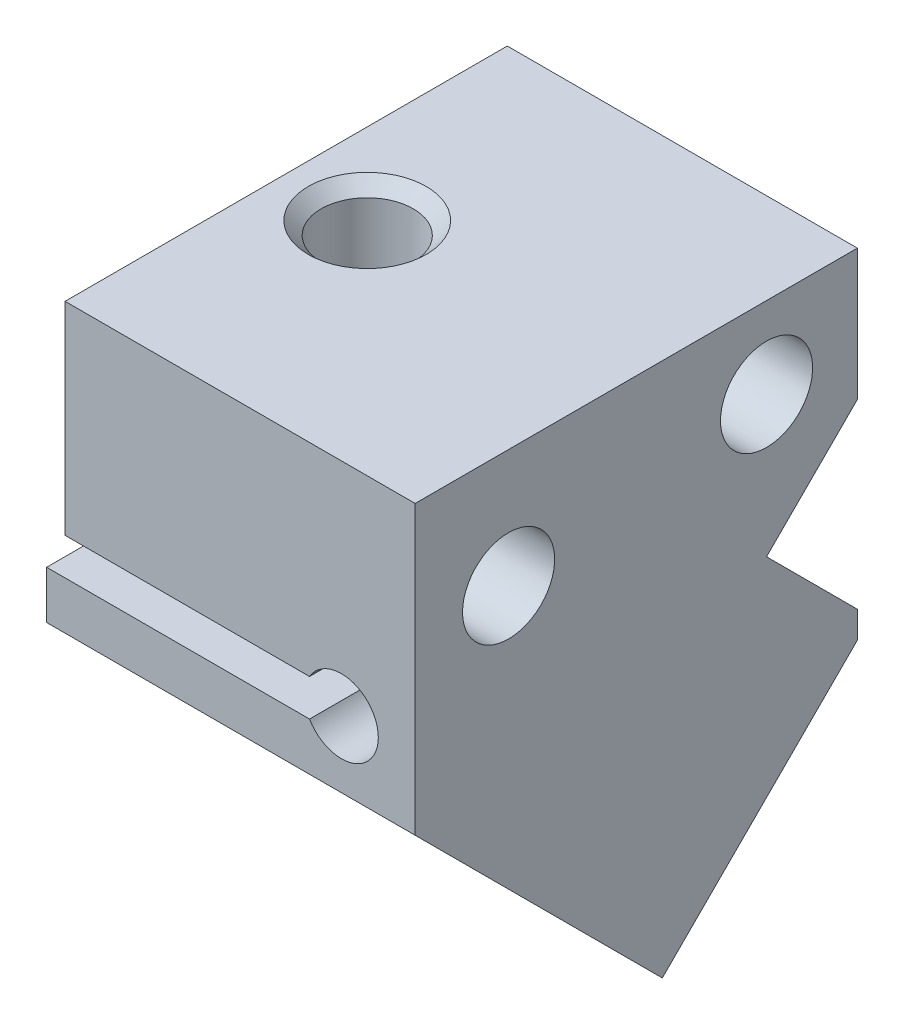
ISO-10303-21;
HEADER;
FILE_DESCRIPTION(('STEP AP214'),'2;1');
FILE_NAME('part.step','',(''),(''),'','','');
FILE_SCHEMA(('AUTOMOTIVE_DESIGN { 1 0 10303 214 1 1 1 1 }'));
ENDSEC;
DATA;
#1=APPLICATION_CONTEXT('core data for automotive mechanical design processes');
#2=APPLICATION_PROTOCOL_DEFINITION('international standard','automotive_design',2000,#1);
#3=PRODUCT_CONTEXT('',#1,'mechanical');
#4=PRODUCT('Part','Part','',(#3));
#5=PRODUCT_RELATED_PRODUCT_CATEGORY('part','',(#4));
#6=PRODUCT_DEFINITION_FORMATION('','',#4);
#7=PRODUCT_DEFINITION_CONTEXT('part definition',#1,'design');
#8=PRODUCT_DEFINITION('design','',#6,#7);
#9=PRODUCT_DEFINITION_SHAPE('','',#8);
#10=(LENGTH_UNIT() NAMED_UNIT(*) SI_UNIT(.MILLI.,.METRE.));
#11=(NAMED_UNIT(*) PLANE_ANGLE_UNIT() SI_UNIT($,.RADIAN.));
#12=(NAMED_UNIT(*) SI_UNIT($,.STERADIAN.) SOLID_ANGLE_UNIT());
#13=UNCERTAINTY_MEASURE_WITH_UNIT(LENGTH_MEASURE(1.E-05),#10,'distance_accuracy_value','');
#14=(GEOMETRIC_REPRESENTATION_CONTEXT(3) GLOBAL_UNCERTAINTY_ASSIGNED_CONTEXT((#13)) GLOBAL_UNIT_ASSIGNED_CONTEXT((#10,
#11,#12)) REPRESENTATION_CONTEXT('',''));
#15=CARTESIAN_POINT('',(0.,0.,0.));
#16=DIRECTION('',(0.,0.,1.));
#17=DIRECTION('',(1.,0.,0.));
#18=AXIS2_PLACEMENT_3D('',#15,#16,#17);
#19=CARTESIAN_POINT('',(10.,0.,-12.));
#20=DIRECTION('',(0.,0.,1.));
#21=DIRECTION('',(0.,-1.,0.));
#22=AXIS2_PLACEMENT_3D('',#19,#20,#21);
#23=PLANE('',#22);
#24=DIRECTION('',(0.,1.,0.));
#25=VECTOR('',#24,1.);
#26=CARTESIAN_POINT('',(10.,0.,-12.));
#27=LINE('',#26,#25);
#28=CARTESIAN_POINT('',(10.,-3.55634918610406,-12.));
#29=VERTEX_POINT('',#28);
#30=CARTESIAN_POINT('',(10.,0.,-12.));
#31=VERTEX_POINT('',#30);
#32=EDGE_CURVE('E101',#29,#31,#27,.T.);
#33=ORIENTED_EDGE('',*,*,#32,.F.);
#34=DIRECTION('',(-1.,0.,0.));
#35=VECTOR('',#34,1.);
#36=CARTESIAN_POINT('',(10.,-3.55634918610406,-12.));
#37=LINE('',#36,#35);
#38=CARTESIAN_POINT('',(0.500000000000001,-3.55634918610406,-12.));
#39=VERTEX_POINT('',#38);
#40=EDGE_CURVE('E290',#29,#39,#37,.T.);
#41=ORIENTED_EDGE('',*,*,#40,.T.);
#42=DIRECTION('',(0.,-1.,0.));
#43=VECTOR('',#42,1.);
#44=CARTESIAN_POINT('',(0.500000000000001,-13.9049249627964,-12.));
#45=LINE('',#44,#43);
#46=CARTESIAN_POINT('',(0.500000000000001,0.,-12.));
#47=VERTEX_POINT('',#46);
#48=EDGE_CURVE('E176',#47,#39,#45,.T.);
#49=ORIENTED_EDGE('',*,*,#48,.F.);
#50=DIRECTION('',(-1.,0.,0.));
#51=VECTOR('',#50,1.);
#52=CARTESIAN_POINT('',(10.,0.,-12.));
#53=LINE('',#52,#51);
#54=EDGE_CURVE('E136',#31,#47,#53,.T.);
#55=ORIENTED_EDGE('',*,*,#54,.F.);
#56=EDGE_LOOP('',(#33,#41,#49,#55));
#57=FACE_BOUND('',#56,.T.);
#58=ADVANCED_FACE('F33',(#57),#23,.F.);
#59=CARTESIAN_POINT('',(10.,-7.79898987322334,0.));
#60=DIRECTION('',(0.,0.,-1.));
#61=DIRECTION('',(0.,1.,0.));
#62=AXIS2_PLACEMENT_3D('',#59,#60,#61);
#63=PLANE('',#62);
#64=DIRECTION('',(-1.,0.,0.));
#65=VECTOR('',#64,1.);
#66=CARTESIAN_POINT('',(5.,-6.5,0.));
#67=LINE('',#66,#65);
#68=CARTESIAN_POINT('',(7.13397459621557,-6.5,0.));
#69=VERTEX_POINT('',#68);
#70=CARTESIAN_POINT('',(0.,-6.5,0.));
#71=VERTEX_POINT('',#70);
#72=EDGE_CURVE('E322',#69,#71,#67,.T.);
#73=ORIENTED_EDGE('',*,*,#72,.T.);
#74=DIRECTION('',(0.,-1.,0.));
#75=VECTOR('',#74,1.);
#76=CARTESIAN_POINT('',(0.,-7.79898987322334,0.));
#77=LINE('',#76,#75);
#78=CARTESIAN_POINT('',(0.,-7.79898987322334,0.));
#79=VERTEX_POINT('',#78);
#80=EDGE_CURVE('E123',#71,#79,#77,.T.);
#81=ORIENTED_EDGE('',*,*,#80,.T.);
#82=DIRECTION('',(-1.,0.,0.));
#83=VECTOR('',#82,1.);
#84=CARTESIAN_POINT('',(10.,-7.79898987322334,0.));
#85=LINE('',#84,#83);
#86=CARTESIAN_POINT('',(10.,-7.79898987322334,0.));
#87=VERTEX_POINT('',#86);
#88=EDGE_CURVE('E141',#87,#79,#85,.T.);
#89=ORIENTED_EDGE('',*,*,#88,.F.);
#90=DIRECTION('',(0.,-1.,0.));
#91=VECTOR('',#90,1.);
#92=CARTESIAN_POINT('',(10.,-7.79898987322334,0.));
#93=LINE('',#92,#91);
#94=CARTESIAN_POINT('',(10.,0.,0.));
#95=VERTEX_POINT('',#94);
#96=EDGE_CURVE('E133',#95,#87,#93,.T.);
#97=ORIENTED_EDGE('',*,*,#96,.F.);
#98=DIRECTION('',(-1.,0.,0.));
#99=VECTOR('',#98,1.);
#100=CARTESIAN_POINT('',(10.,0.,0.));
#101=LINE('',#100,#99);
#102=CARTESIAN_POINT('',(0.500000000000001,0.,0.));
#103=VERTEX_POINT('',#102);
#104=EDGE_CURVE('E119',#95,#103,#101,.T.);
#105=ORIENTED_EDGE('',*,*,#104,.T.);
#106=DIRECTION('',(0.,-1.,0.));
#107=VECTOR('',#106,1.);
#108=CARTESIAN_POINT('',(0.500000000000001,-13.9049249627964,0.));
#109=LINE('',#108,#107);
#110=CARTESIAN_POINT('',(0.500000000000001,-5.5,0.));
#111=VERTEX_POINT('',#110);
#112=EDGE_CURVE('E326',#103,#111,#109,.T.);
#113=ORIENTED_EDGE('',*,*,#112,.T.);
#114=DIRECTION('',(1.,0.,0.));
#115=VECTOR('',#114,1.);
#116=CARTESIAN_POINT('',(5.,-5.5,0.));
#117=LINE('',#116,#115);
#118=CARTESIAN_POINT('',(7.13397459621557,-5.5,0.));
#119=VERTEX_POINT('',#118);
#120=EDGE_CURVE('E182',#111,#119,#117,.T.);
#121=ORIENTED_EDGE('',*,*,#120,.T.);
#122=CARTESIAN_POINT('',(8.00000000000001,-6.,0.));
#123=DIRECTION('',(0.,0.,1.));
#124=DIRECTION('',(1.,0.,0.));
#125=AXIS2_PLACEMENT_3D('',#122,#123,#124);
#126=CIRCLE('',#125,1.);
#127=EDGE_CURVE('E320',#119,#69,#126,.F.);
#128=ORIENTED_EDGE('',*,*,#127,.T.);
#129=EDGE_LOOP('',(#73,#81,#89,#97,#105,#113,#121,#128));
#130=FACE_BOUND('',#129,.T.);
#131=ADVANCED_FACE('F35',(#130),#63,.F.);
#132=DIRECTION('',(0.,1.,0.));
#133=VECTOR('',#132,1.);
#134=CARTESIAN_POINT('',(0.,0.,-12.));
#135=LINE('',#134,#133);
#136=CARTESIAN_POINT('',(0.,-9.21320343559643,-12.));
#137=VERTEX_POINT('',#136);
#138=CARTESIAN_POINT('',(0.,-8.48528137423857,-12.));
#139=VERTEX_POINT('',#138);
#140=EDGE_CURVE('E131',#137,#139,#135,.T.);
#141=ORIENTED_EDGE('',*,*,#140,.T.);
#142=DIRECTION('',(1.,0.,0.));
#143=VECTOR('',#142,1.);
#144=CARTESIAN_POINT('',(10.,-8.48528137423857,-12.));
#145=LINE('',#144,#143);
#146=CARTESIAN_POINT('',(1.,-8.48528137423857,-12.));
#147=VERTEX_POINT('',#146);
#148=EDGE_CURVE('E344',#139,#147,#145,.T.);
#149=ORIENTED_EDGE('',*,*,#148,.T.);
#150=DIRECTION('',(0.,-1.,0.));
#151=VECTOR('',#150,1.);
#152=CARTESIAN_POINT('',(1.,0.,-12.));
#153=LINE('',#152,#151);
#154=CARTESIAN_POINT('',(1.,-9.21320343559644,-12.));
#155=VERTEX_POINT('',#154);
#156=EDGE_CURVE('E143',#147,#155,#153,.T.);
#157=ORIENTED_EDGE('',*,*,#156,.T.);
#158=DIRECTION('',(-1.,0.,0.));
#159=VECTOR('',#158,1.);
#160=CARTESIAN_POINT('',(10.,-9.21320343559643,-12.));
#161=LINE('',#160,#159);
#162=EDGE_CURVE('E76',#155,#137,#161,.T.);
#163=ORIENTED_EDGE('',*,*,#162,.T.);
#164=EDGE_LOOP('',(#141,#149,#157,#163));
#165=FACE_BOUND('',#164,.T.);
#166=ADVANCED_FACE('F357',(#165),#23,.F.);
#167=DIRECTION('',(0.,1.,0.));
#168=VECTOR('',#167,1.);
#169=CARTESIAN_POINT('',(9.,0.,-12.));
#170=LINE('',#169,#168);
#171=CARTESIAN_POINT('',(9.,-9.21320343559644,-12.));
#172=VERTEX_POINT('',#171);
#173=CARTESIAN_POINT('',(9.,-8.48528137423857,-12.));
#174=VERTEX_POINT('',#173);
#175=EDGE_CURVE('E145',#172,#174,#170,.T.);
#176=ORIENTED_EDGE('',*,*,#175,.T.);
#177=DIRECTION('',(1.,0.,0.));
#178=VECTOR('',#177,1.);
#179=CARTESIAN_POINT('',(10.,-8.48528137423857,-12.));
#180=LINE('',#179,#178);
#181=CARTESIAN_POINT('',(10.,-8.48528137423857,-12.));
#182=VERTEX_POINT('',#181);
#183=EDGE_CURVE('E117',#174,#182,#180,.T.);
#184=ORIENTED_EDGE('',*,*,#183,.T.);
#185=CARTESIAN_POINT('',(10.,-9.21320343559643,-12.));
#186=VERTEX_POINT('',#185);
#187=EDGE_CURVE('E98',#186,#182,#27,.T.);
#188=ORIENTED_EDGE('',*,*,#187,.F.);
#189=EDGE_CURVE('E105',#186,#172,#161,.T.);
#190=ORIENTED_EDGE('',*,*,#189,.T.);
#191=EDGE_LOOP('',(#176,#184,#188,#190));
#192=FACE_BOUND('',#191,.T.);
#193=ADVANCED_FACE('F115',(#192),#23,.F.);
#194=CARTESIAN_POINT('',(10.,0.,0.));
#195=DIRECTION('',(0.,-1.,0.));
#196=DIRECTION('',(0.,0.,-1.));
#197=AXIS2_PLACEMENT_3D('',#194,#195,#196);
#198=PLANE('',#197);
#199=CARTESIAN_POINT('',(2.7,0.,-6.));
#200=DIRECTION('',(0.,1.,0.));
#201=DIRECTION('',(0.,0.,1.));
#202=AXIS2_PLACEMENT_3D('',#199,#200,#201);
#203=CIRCLE('',#202,1.6);
#204=CARTESIAN_POINT('',(2.7,0.,-4.4));
#205=VERTEX_POINT('',#204);
#206=EDGE_CURVE('E299',#205,#205,#203,.T.);
#207=ORIENTED_EDGE('',*,*,#206,.F.);
#208=EDGE_LOOP('',(#207));
#209=FACE_BOUND('',#208,.T.);
#210=DIRECTION('',(0.,0.,1.));
#211=VECTOR('',#210,1.);
#212=CARTESIAN_POINT('',(0.500000000000001,0.,-12.));
#213=LINE('',#212,#211);
#214=EDGE_CURVE('E184',#47,#103,#213,.T.);
#215=ORIENTED_EDGE('',*,*,#214,.T.);
#216=ORIENTED_EDGE('',*,*,#104,.F.);
#217=DIRECTION('',(0.,0.,1.));
#218=VECTOR('',#217,1.);
#219=CARTESIAN_POINT('',(10.,0.,0.));
#220=LINE('',#219,#218);
#221=EDGE_CURVE('E57',#31,#95,#220,.T.);
#222=ORIENTED_EDGE('',*,*,#221,.F.);
#223=ORIENTED_EDGE('',*,*,#54,.T.);
#224=EDGE_LOOP('',(#215,#216,#222,#223));
#225=FACE_BOUND('',#224,.T.);
#226=ADVANCED_FACE('F364',(#209,#225),#198,.F.);
#227=CARTESIAN_POINT('',(0.,0.,0.));
#228=DIRECTION('',(-1.,0.,0.));
#229=DIRECTION('',(0.,0.,1.));
#230=AXIS2_PLACEMENT_3D('',#227,#228,#229);
#231=PLANE('',#230);
#232=DIRECTION('',(0.,0.707106781186547,0.707106781186548));
#233=VECTOR('',#232,1.);
#234=CARTESIAN_POINT('',(0.,1.75735931288071,-1.75735931288071));
#235=LINE('',#234,#233);
#236=CARTESIAN_POINT('',(0.,-6.5,-10.0147186257614));
#237=VERTEX_POINT('',#236);
#238=EDGE_CURVE('E342',#139,#237,#235,.T.);
#239=ORIENTED_EDGE('',*,*,#238,.F.);
#240=ORIENTED_EDGE('',*,*,#140,.F.);
#241=DIRECTION('',(0.,0.707106781186548,-0.707106781186547));
#242=VECTOR('',#241,1.);
#243=CARTESIAN_POINT('',(0.,-9.21320343559643,-12.));
#244=LINE('',#243,#242);
#245=CARTESIAN_POINT('',(0.,-14.5060966544099,-6.70710678118656));
#246=VERTEX_POINT('',#245);
#247=EDGE_CURVE('E129',#246,#137,#244,.T.);
#248=ORIENTED_EDGE('',*,*,#247,.F.);
#249=DIRECTION('',(0.,-0.707106781186547,-0.707106781186548));
#250=VECTOR('',#249,1.);
#251=CARTESIAN_POINT('',(0.,-14.5060966544099,-6.70710678118656));
#252=LINE('',#251,#250);
#253=EDGE_CURVE('E125',#79,#246,#252,.T.);
#254=ORIENTED_EDGE('',*,*,#253,.F.);
#255=ORIENTED_EDGE('',*,*,#80,.F.);
#256=DIRECTION('',(0.,0.,1.));
#257=VECTOR('',#256,1.);
#258=CARTESIAN_POINT('',(0.,-6.5,-12.));
#259=LINE('',#258,#257);
#260=EDGE_CURVE('E188',#237,#71,#259,.T.);
#261=ORIENTED_EDGE('',*,*,#260,.F.);
#262=EDGE_LOOP('',(#239,#240,#248,#254,#255,#261));
#263=FACE_BOUND('',#262,.T.);
#264=ADVANCED_FACE('F226',(#263),#231,.T.);
#265=CARTESIAN_POINT('',(1.,-3.81379132395069,-14.5709849868995));
#266=DIRECTION('',(-1.,0.,0.));
#267=DIRECTION('',(0.,-1.,0.));
#268=AXIS2_PLACEMENT_3D('',#265,#266,#267);
#269=PLANE('',#268);
#270=ORIENTED_EDGE('',*,*,#156,.F.);
#271=DIRECTION('',(0.,0.707106781186547,0.707106781186548));
#272=VECTOR('',#271,1.);
#273=CARTESIAN_POINT('',(1.,-7.43502884254441,-10.9497474683058));
#274=LINE('',#273,#272);
#275=CARTESIAN_POINT('',(1.,-7.43502884254441,-10.9497474683058));
#276=VERTEX_POINT('',#275);
#277=EDGE_CURVE('E346',#147,#276,#274,.T.);
#278=ORIENTED_EDGE('',*,*,#277,.T.);
#279=DIRECTION('',(0.,0.707106781186548,-0.707106781186547));
#280=VECTOR('',#279,1.);
#281=CARTESIAN_POINT('',(1.,-3.81379132395069,-14.5709849868995));
#282=LINE('',#281,#280);
#283=CARTESIAN_POINT('',(0.999999999999998,-13.0918830920368,-5.29289321881346));
#284=VERTEX_POINT('',#283);
#285=EDGE_CURVE('E196',#284,#276,#282,.T.);
#286=ORIENTED_EDGE('',*,*,#285,.F.);
#287=DIRECTION('',(0.,0.707106781186547,0.707106781186548));
#288=VECTOR('',#287,1.);
#289=CARTESIAN_POINT('',(0.999999999999997,-14.5060966544099,-6.70710678118656));
#290=LINE('',#289,#288);
#291=CARTESIAN_POINT('',(0.999999999999998,-14.5060966544099,-6.70710678118656));
#292=VERTEX_POINT('',#291);
#293=EDGE_CURVE('E207',#292,#284,#290,.T.);
#294=ORIENTED_EDGE('',*,*,#293,.F.);
#295=DIRECTION('',(0.,0.707106781186548,-0.707106781186547));
#296=VECTOR('',#295,1.);
#297=CARTESIAN_POINT('',(1.,-5.22800488632379,-15.9851985492726));
#298=LINE('',#297,#296);
#299=EDGE_CURVE('E197',#292,#155,#298,.T.);
#300=ORIENTED_EDGE('',*,*,#299,.T.);
#301=EDGE_LOOP('',(#270,#278,#286,#294,#300));
#302=FACE_BOUND('',#301,.T.);
#303=ADVANCED_FACE('F236',(#302),#269,.F.);
#304=CARTESIAN_POINT('',(9.,-14.9422130427068,-3.44256326814347));
#305=DIRECTION('',(0.,-0.707106781186547,-0.707106781186548));
#306=DIRECTION('',(0.,0.707106781186548,-0.707106781186547));
#307=AXIS2_PLACEMENT_3D('',#304,#305,#306);
#308=PLANE('',#307);
#309=DIRECTION('',(-1.,0.,0.));
#310=VECTOR('',#309,1.);
#311=CARTESIAN_POINT('',(9.,-7.43502884254441,-10.9497474683058));
#312=LINE('',#311,#310);
#313=CARTESIAN_POINT('',(9.,-7.43502884254441,-10.9497474683058));
#314=VERTEX_POINT('',#313);
#315=EDGE_CURVE('E348',#314,#276,#312,.T.);
#316=ORIENTED_EDGE('',*,*,#315,.F.);
#317=DIRECTION('',(0.,-0.707106781186548,0.707106781186547));
#318=VECTOR('',#317,1.);
#319=CARTESIAN_POINT('',(9.,-3.81379132395069,-14.5709849868995));
#320=LINE('',#319,#318);
#321=CARTESIAN_POINT('',(9.,-13.0918830920368,-5.29289321881346));
#322=VERTEX_POINT('',#321);
#323=EDGE_CURVE('E193',#314,#322,#320,.T.);
#324=ORIENTED_EDGE('',*,*,#323,.T.);
#325=DIRECTION('',(-1.,0.,0.));
#326=VECTOR('',#325,1.);
#327=CARTESIAN_POINT('',(10.,-13.0918830920368,-5.29289321881346));
#328=LINE('',#327,#326);
#329=EDGE_CURVE('E200',#322,#284,#328,.T.);
#330=ORIENTED_EDGE('',*,*,#329,.T.);
#331=ORIENTED_EDGE('',*,*,#285,.T.);
#332=EDGE_LOOP('',(#316,#324,#330,#331));
#333=FACE_BOUND('',#332,.T.);
#334=ADVANCED_FACE('F356',(#333),#308,.T.);
#335=CARTESIAN_POINT('',(10.,-9.21320343559643,-12.));
#336=DIRECTION('',(0.,0.707106781186547,0.707106781186548));
#337=DIRECTION('',(0.,-0.707106781186548,0.707106781186547));
#338=AXIS2_PLACEMENT_3D('',#335,#336,#337);
#339=PLANE('',#338);
#340=DIRECTION('',(-1.,0.,0.));
#341=VECTOR('',#340,1.);
#342=CARTESIAN_POINT('',(10.,-14.5060966544099,-6.70710678118656));
#343=LINE('',#342,#341);
#344=CARTESIAN_POINT('',(10.,-14.5060966544099,-6.70710678118656));
#345=VERTEX_POINT('',#344);
#346=CARTESIAN_POINT('',(9.,-14.5060966544099,-6.70710678118656));
#347=VERTEX_POINT('',#346);
#348=EDGE_CURVE('E139',#345,#347,#343,.T.);
#349=ORIENTED_EDGE('',*,*,#348,.T.);
#350=DIRECTION('',(0.,-0.707106781186548,0.707106781186547));
#351=VECTOR('',#350,1.);
#352=CARTESIAN_POINT('',(9.,-5.22800488632379,-15.9851985492726));
#353=LINE('',#352,#351);
#354=EDGE_CURVE('E109',#172,#347,#353,.T.);
#355=ORIENTED_EDGE('',*,*,#354,.F.);
#356=ORIENTED_EDGE('',*,*,#189,.F.);
#357=DIRECTION('',(0.,0.707106781186548,-0.707106781186547));
#358=VECTOR('',#357,1.);
#359=CARTESIAN_POINT('',(10.,-9.21320343559643,-12.));
#360=LINE('',#359,#358);
#361=EDGE_CURVE('E92',#345,#186,#360,.T.);
#362=ORIENTED_EDGE('',*,*,#361,.F.);
#363=EDGE_LOOP('',(#349,#355,#356,#362));
#364=FACE_BOUND('',#363,.T.);
#365=ADVANCED_FACE('F106',(#364),#339,.F.);
#366=CARTESIAN_POINT('',(10.,-14.5060966544099,-6.70710678118656));
#367=DIRECTION('',(0.,0.707106781186548,-0.707106781186547));
#368=DIRECTION('',(0.,0.707106781186547,0.707106781186548));
#369=AXIS2_PLACEMENT_3D('',#366,#367,#368);
#370=PLANE('',#369);
#371=ORIENTED_EDGE('',*,*,#329,.F.);
#372=DIRECTION('',(0.,-0.707106781186547,-0.707106781186548));
#373=VECTOR('',#372,1.);
#374=CARTESIAN_POINT('',(9.,-14.5060966544099,-6.70710678118656));
#375=LINE('',#374,#373);
#376=EDGE_CURVE('E126',#322,#347,#375,.T.);
#377=ORIENTED_EDGE('',*,*,#376,.T.);
#378=ORIENTED_EDGE('',*,*,#348,.F.);
#379=DIRECTION('',(0.,-0.707106781186547,-0.707106781186548));
#380=VECTOR('',#379,1.);
#381=CARTESIAN_POINT('',(10.,-14.5060966544099,-6.70710678118656));
#382=LINE('',#381,#380);
#383=EDGE_CURVE('E85',#87,#345,#382,.T.);
#384=ORIENTED_EDGE('',*,*,#383,.F.);
#385=ORIENTED_EDGE('',*,*,#88,.T.);
#386=ORIENTED_EDGE('',*,*,#253,.T.);
#387=EDGE_CURVE('E112',#292,#246,#343,.T.);
#388=ORIENTED_EDGE('',*,*,#387,.F.);
#389=ORIENTED_EDGE('',*,*,#293,.T.);
#390=EDGE_LOOP('',(#371,#377,#378,#384,#385,#386,#388,#389));
#391=FACE_BOUND('',#390,.T.);
#392=ADVANCED_FACE('F219',(#391),#370,.F.);
#393=ORIENTED_EDGE('',*,*,#162,.F.);
#394=ORIENTED_EDGE('',*,*,#299,.F.);
#395=ORIENTED_EDGE('',*,*,#387,.T.);
#396=ORIENTED_EDGE('',*,*,#247,.T.);
#397=EDGE_LOOP('',(#393,#394,#395,#396));
#398=FACE_BOUND('',#397,.T.);
#399=ADVANCED_FACE('F228',(#398),#339,.F.);
#400=CARTESIAN_POINT('',(10.,0.,0.));
#401=DIRECTION('',(-1.,0.,0.));
#402=DIRECTION('',(0.,0.,1.));
#403=AXIS2_PLACEMENT_3D('',#400,#401,#402);
#404=PLANE('',#403);
#405=CARTESIAN_POINT('',(9.99999999999999,-2.20243866176394,-9.53553390593272));
#406=DIRECTION('',(-1.,0.,0.));
#407=DIRECTION('',(0.,0.,1.));
#408=AXIS2_PLACEMENT_3D('',#405,#406,#407);
#409=CIRCLE('',#408,1.24999999999999);
#410=CARTESIAN_POINT('',(9.99999999999999,-2.20243866176394,-8.28553390593273));
#411=VERTEX_POINT('',#410);
#412=EDGE_CURVE('E150',#411,#411,#409,.T.);
#413=ORIENTED_EDGE('',*,*,#412,.T.);
#414=EDGE_LOOP('',(#413));
#415=FACE_BOUND('',#414,.T.);
#416=CARTESIAN_POINT('',(9.99999999999999,-3.20243866176394,-2.53553390593272));
#417=DIRECTION('',(-1.,0.,0.));
#418=DIRECTION('',(0.,0.,1.));
#419=AXIS2_PLACEMENT_3D('',#416,#417,#418);
#420=CIRCLE('',#419,1.24999999999999);
#421=CARTESIAN_POINT('',(9.99999999999999,-3.20243866176394,-1.28553390593273));
#422=VERTEX_POINT('',#421);
#423=EDGE_CURVE('E149',#422,#422,#420,.T.);
#424=ORIENTED_EDGE('',*,*,#423,.T.);
#425=EDGE_LOOP('',(#424));
#426=FACE_BOUND('',#425,.T.);
#427=DIRECTION('',(0.,0.707106781186547,0.707106781186548));
#428=VECTOR('',#427,1.);
#429=CARTESIAN_POINT('',(10.,1.75735931288071,-1.75735931288071));
#430=LINE('',#429,#428);
#431=CARTESIAN_POINT('',(10.,-6.02081528017131,-9.53553390593274));
#432=VERTEX_POINT('',#431);
#433=EDGE_CURVE('E296',#182,#432,#430,.T.);
#434=ORIENTED_EDGE('',*,*,#433,.T.);
#435=DIRECTION('',(0.,0.707106781186548,-0.707106781186547));
#436=VECTOR('',#435,1.);
#437=CARTESIAN_POINT('',(10.,-7.77817459305203,-7.77817459305203));
#438=LINE('',#437,#436);
#439=EDGE_CURVE('E288',#432,#29,#438,.T.);
#440=ORIENTED_EDGE('',*,*,#439,.T.);
#441=ORIENTED_EDGE('',*,*,#32,.T.);
#442=ORIENTED_EDGE('',*,*,#221,.T.);
#443=ORIENTED_EDGE('',*,*,#96,.T.);
#444=ORIENTED_EDGE('',*,*,#383,.T.);
#445=ORIENTED_EDGE('',*,*,#361,.T.);
#446=ORIENTED_EDGE('',*,*,#187,.T.);
#447=EDGE_LOOP('',(#434,#440,#441,#442,#443,#444,#445,#446));
#448=FACE_BOUND('',#447,.T.);
#449=ADVANCED_FACE('F95',(#415,#426,#448),#404,.F.);
#450=CARTESIAN_POINT('',(9.,-3.81379132395069,-14.5709849868995));
#451=DIRECTION('',(1.,0.,0.));
#452=DIRECTION('',(0.,1.,0.));
#453=AXIS2_PLACEMENT_3D('',#450,#451,#452);
#454=PLANE('',#453);
#455=ORIENTED_EDGE('',*,*,#323,.F.);
#456=DIRECTION('',(0.,-0.707106781186547,-0.707106781186548));
#457=VECTOR('',#456,1.);
#458=CARTESIAN_POINT('',(9.,-7.43502884254441,-10.9497474683058));
#459=LINE('',#458,#457);
#460=EDGE_CURVE('E304',#314,#174,#459,.T.);
#461=ORIENTED_EDGE('',*,*,#460,.T.);
#462=ORIENTED_EDGE('',*,*,#175,.F.);
#463=ORIENTED_EDGE('',*,*,#354,.T.);
#464=ORIENTED_EDGE('',*,*,#376,.F.);
#465=EDGE_LOOP('',(#455,#461,#462,#463,#464));
#466=FACE_BOUND('',#465,.T.);
#467=ADVANCED_FACE('F352',(#466),#454,.F.);
#468=CARTESIAN_POINT('',(5.,-6.5,-12.));
#469=DIRECTION('',(0.,1.,0.));
#470=DIRECTION('',(-1.,0.,0.));
#471=AXIS2_PLACEMENT_3D('',#468,#469,#470);
#472=PLANE('',#471);
#473=DIRECTION('',(1.,0.,0.));
#474=VECTOR('',#473,1.);
#475=CARTESIAN_POINT('',(5.,-6.5,-10.0147186257614));
#476=LINE('',#475,#474);
#477=CARTESIAN_POINT('',(7.13397459621557,-6.5,-10.0147186257614));
#478=VERTEX_POINT('',#477);
#479=EDGE_CURVE('E292',#237,#478,#476,.T.);
#480=ORIENTED_EDGE('',*,*,#479,.F.);
#481=ORIENTED_EDGE('',*,*,#260,.T.);
#482=ORIENTED_EDGE('',*,*,#72,.F.);
#483=DIRECTION('',(0.,0.,1.));
#484=VECTOR('',#483,1.);
#485=CARTESIAN_POINT('',(7.13397459621557,-6.5,-12.));
#486=LINE('',#485,#484);
#487=EDGE_CURVE('E202',#478,#69,#486,.T.);
#488=ORIENTED_EDGE('',*,*,#487,.F.);
#489=EDGE_LOOP('',(#480,#481,#482,#488));
#490=FACE_BOUND('',#489,.T.);
#491=ADVANCED_FACE('F333',(#490),#472,.T.);
#492=CARTESIAN_POINT('',(8.00000000000001,-6.,-12.));
#493=DIRECTION('',(0.,0.,1.));
#494=DIRECTION('',(1.,0.,0.));
#495=AXIS2_PLACEMENT_3D('',#492,#493,#494);
#496=CYLINDRICAL_SURFACE('',#495,1.);
#497=CARTESIAN_POINT('',(8.00000000000001,-6.,-9.55634918610406));
#498=DIRECTION('',(0.,0.707106781186547,0.707106781186548));
#499=DIRECTION('',(0.,-0.707106781186548,0.707106781186547));
#500=AXIS2_PLACEMENT_3D('',#497,#498,#499);
#501=ELLIPSE('',#500,1.4142135623731,1.);
#502=CARTESIAN_POINT('',(8.99978333858462,-6.02081528017131,-9.53553390593274));
#503=VERTEX_POINT('',#502);
#504=CARTESIAN_POINT('',(7.13397459621557,-5.5,-10.0563491861041));
#505=VERTEX_POINT('',#504);
#506=EDGE_CURVE('E48',#503,#505,#501,.T.);
#507=ORIENTED_EDGE('',*,*,#506,.F.);
#508=CARTESIAN_POINT('',(8.00000000000001,-6.,-9.51471862576143));
#509=DIRECTION('',(0.,-0.707106781186548,0.707106781186547));
#510=DIRECTION('',(0.,0.707106781186547,0.707106781186548));
#511=AXIS2_PLACEMENT_3D('',#508,#509,#510);
#512=ELLIPSE('',#511,1.4142135623731,1.);
#513=EDGE_CURVE('E11',#478,#503,#512,.T.);
#514=ORIENTED_EDGE('',*,*,#513,.F.);
#515=ORIENTED_EDGE('',*,*,#487,.T.);
#516=ORIENTED_EDGE('',*,*,#127,.F.);
#517=DIRECTION('',(0.,0.,1.));
#518=VECTOR('',#517,1.);
#519=CARTESIAN_POINT('',(7.13397459621557,-5.5,-12.));
#520=LINE('',#519,#518);
#521=EDGE_CURVE('E185',#505,#119,#520,.T.);
#522=ORIENTED_EDGE('',*,*,#521,.F.);
#523=EDGE_LOOP('',(#507,#514,#515,#516,#522));
#524=FACE_BOUND('',#523,.T.);
#525=ADVANCED_FACE('F337',(#524),#496,.F.);
#526=CARTESIAN_POINT('',(0.500000000000001,-13.9049249627964,-12.));
#527=DIRECTION('',(-1.,0.,0.));
#528=DIRECTION('',(0.,-1.,0.));
#529=AXIS2_PLACEMENT_3D('',#526,#527,#528);
#530=PLANE('',#529);
#531=DIRECTION('',(0.,0.707106781186548,-0.707106781186547));
#532=VECTOR('',#531,1.);
#533=CARTESIAN_POINT('',(0.500000000000001,-8.73063707445022,-6.82571211165385));
#534=LINE('',#533,#532);
#535=CARTESIAN_POINT('',(0.5,-5.5,-10.0563491861041));
#536=VERTEX_POINT('',#535);
#537=EDGE_CURVE('E157',#536,#39,#534,.T.);
#538=ORIENTED_EDGE('',*,*,#537,.F.);
#539=DIRECTION('',(0.,0.,1.));
#540=VECTOR('',#539,1.);
#541=CARTESIAN_POINT('',(0.500000000000001,-5.5,-12.));
#542=LINE('',#541,#540);
#543=EDGE_CURVE('E172',#536,#111,#542,.T.);
#544=ORIENTED_EDGE('',*,*,#543,.T.);
#545=ORIENTED_EDGE('',*,*,#112,.F.);
#546=ORIENTED_EDGE('',*,*,#214,.F.);
#547=ORIENTED_EDGE('',*,*,#48,.T.);
#548=EDGE_LOOP('',(#538,#544,#545,#546,#547));
#549=FACE_BOUND('',#548,.T.);
#550=CARTESIAN_POINT('',(0.500000000000001,-2.20243866176394,-9.53553390593272));
#551=DIRECTION('',(-1.,0.,0.));
#552=DIRECTION('',(0.,-1.,0.));
#553=AXIS2_PLACEMENT_3D('',#550,#551,#552);
#554=CIRCLE('',#553,1.24999999999999);
#555=CARTESIAN_POINT('',(0.500000000000001,-3.45243866176392,-9.53553390593272));
#556=VERTEX_POINT('',#555);
#557=EDGE_CURVE('E147',#556,#556,#554,.T.);
#558=ORIENTED_EDGE('',*,*,#557,.F.);
#559=EDGE_LOOP('',(#558));
#560=FACE_BOUND('',#559,.T.);
#561=CARTESIAN_POINT('',(0.500000000000001,-3.20243866176394,-2.53553390593272));
#562=DIRECTION('',(-1.,0.,0.));
#563=DIRECTION('',(0.,-1.,0.));
#564=AXIS2_PLACEMENT_3D('',#561,#562,#563);
#565=CIRCLE('',#564,1.24999999999999);
#566=CARTESIAN_POINT('',(0.500000000000001,-4.45243866176392,-2.53553390593272));
#567=VERTEX_POINT('',#566);
#568=EDGE_CURVE('E317',#567,#567,#565,.T.);
#569=ORIENTED_EDGE('',*,*,#568,.F.);
#570=EDGE_LOOP('',(#569));
#571=FACE_BOUND('',#570,.T.);
#572=ADVANCED_FACE('F168',(#549,#560,#571),#530,.T.);
#573=CARTESIAN_POINT('',(5.,-5.5,-12.));
#574=DIRECTION('',(0.,-1.,0.));
#575=DIRECTION('',(0.,0.,-1.));
#576=AXIS2_PLACEMENT_3D('',#573,#574,#575);
#577=PLANE('',#576);
#578=DIRECTION('',(-1.,0.,0.));
#579=VECTOR('',#578,1.);
#580=CARTESIAN_POINT('',(5.,-5.5,-10.0563491861041));
#581=LINE('',#580,#579);
#582=EDGE_CURVE('E41',#505,#536,#581,.T.);
#583=ORIENTED_EDGE('',*,*,#582,.F.);
#584=ORIENTED_EDGE('',*,*,#521,.T.);
#585=ORIENTED_EDGE('',*,*,#120,.F.);
#586=ORIENTED_EDGE('',*,*,#543,.F.);
#587=EDGE_LOOP('',(#583,#584,#585,#586));
#588=FACE_BOUND('',#587,.T.);
#589=CARTESIAN_POINT('',(2.7,-5.5,-6.));
#590=DIRECTION('',(0.,-1.,0.));
#591=DIRECTION('',(0.,0.,-1.));
#592=AXIS2_PLACEMENT_3D('',#589,#590,#591);
#593=CIRCLE('',#592,1.25);
#594=CARTESIAN_POINT('',(2.7,-5.5,-7.25));
#595=VERTEX_POINT('',#594);
#596=EDGE_CURVE('E310',#595,#595,#593,.T.);
#597=ORIENTED_EDGE('',*,*,#596,.F.);
#598=EDGE_LOOP('',(#597));
#599=FACE_BOUND('',#598,.T.);
#600=ADVANCED_FACE('F179',(#588,#599),#577,.T.);
#601=CARTESIAN_POINT('',(0.,-3.20243866176394,-2.53553390593272));
#602=DIRECTION('',(-1.,0.,0.));
#603=DIRECTION('',(0.,0.,1.));
#604=AXIS2_PLACEMENT_3D('',#601,#602,#603);
#605=CYLINDRICAL_SURFACE('',#604,1.24999999999999);
#606=ORIENTED_EDGE('',*,*,#568,.T.);
#607=EDGE_LOOP('',(#606));
#608=FACE_BOUND('',#607,.T.);
#609=ORIENTED_EDGE('',*,*,#423,.F.);
#610=EDGE_LOOP('',(#609));
#611=FACE_BOUND('',#610,.T.);
#612=ADVANCED_FACE('F394',(#608,#611),#605,.F.);
#613=CARTESIAN_POINT('',(0.,-2.20243866176394,-9.53553390593272));
#614=DIRECTION('',(-1.,0.,0.));
#615=DIRECTION('',(0.,0.,1.));
#616=AXIS2_PLACEMENT_3D('',#613,#614,#615);
#617=CYLINDRICAL_SURFACE('',#616,1.24999999999999);
#618=ORIENTED_EDGE('',*,*,#557,.T.);
#619=EDGE_LOOP('',(#618));
#620=FACE_BOUND('',#619,.T.);
#621=ORIENTED_EDGE('',*,*,#412,.F.);
#622=EDGE_LOOP('',(#621));
#623=FACE_BOUND('',#622,.T.);
#624=ADVANCED_FACE('F401',(#620,#623),#617,.F.);
#625=CARTESIAN_POINT('',(2.7,0.,-6.));
#626=DIRECTION('',(0.,1.,0.));
#627=DIRECTION('',(0.,0.,1.));
#628=AXIS2_PLACEMENT_3D('',#625,#626,#627);
#629=CYLINDRICAL_SURFACE('',#628,1.25);
#630=CARTESIAN_POINT('',(2.7,-0.35,-6.));
#631=DIRECTION('',(0.,1.,0.));
#632=DIRECTION('',(0.,0.,1.));
#633=AXIS2_PLACEMENT_3D('',#630,#631,#632);
#634=CIRCLE('',#633,1.25);
#635=CARTESIAN_POINT('',(2.7,-0.35,-4.75));
#636=VERTEX_POINT('',#635);
#637=EDGE_CURVE('E302',#636,#636,#634,.T.);
#638=ORIENTED_EDGE('',*,*,#637,.T.);
#639=EDGE_LOOP('',(#638));
#640=FACE_BOUND('',#639,.T.);
#641=ORIENTED_EDGE('',*,*,#596,.T.);
#642=EDGE_LOOP('',(#641));
#643=FACE_BOUND('',#642,.T.);
#644=ADVANCED_FACE('F405',(#640,#643),#629,.F.);
#645=CARTESIAN_POINT('',(2.7,0.,-6.));
#646=DIRECTION('',(0.,1.,0.));
#647=DIRECTION('',(0.,0.,1.));
#648=AXIS2_PLACEMENT_3D('',#645,#646,#647);
#649=CONICAL_SURFACE('',#648,1.6,0.785398163397447);
#650=ORIENTED_EDGE('',*,*,#637,.F.);
#651=EDGE_LOOP('',(#650));
#652=FACE_BOUND('',#651,.T.);
#653=ORIENTED_EDGE('',*,*,#206,.T.);
#654=EDGE_LOOP('',(#653));
#655=FACE_BOUND('',#654,.T.);
#656=ADVANCED_FACE('F409',(#652,#655),#649,.F.);
#657=CARTESIAN_POINT('',(11.601210509716,-6.02081528017131,-9.53553390593274));
#658=DIRECTION('',(0.,-0.707106781186548,0.707106781186547));
#659=DIRECTION('',(0.,-0.707106781186547,-0.707106781186548));
#660=AXIS2_PLACEMENT_3D('',#657,#658,#659);
#661=PLANE('',#660);
#662=ORIENTED_EDGE('',*,*,#183,.F.);
#663=ORIENTED_EDGE('',*,*,#460,.F.);
#664=ORIENTED_EDGE('',*,*,#315,.T.);
#665=ORIENTED_EDGE('',*,*,#277,.F.);
#666=ORIENTED_EDGE('',*,*,#148,.F.);
#667=ORIENTED_EDGE('',*,*,#238,.T.);
#668=ORIENTED_EDGE('',*,*,#479,.T.);
#669=ORIENTED_EDGE('',*,*,#513,.T.);
#670=DIRECTION('',(-1.,0.,0.));
#671=VECTOR('',#670,1.);
#672=CARTESIAN_POINT('',(11.601210509716,-6.02081528017131,-9.53553390593274));
#673=LINE('',#672,#671);
#674=EDGE_CURVE('E177',#432,#503,#673,.T.);
#675=ORIENTED_EDGE('',*,*,#674,.F.);
#676=ORIENTED_EDGE('',*,*,#433,.F.);
#677=EDGE_LOOP('',(#662,#663,#664,#665,#666,#667,#668,#669,#675,#676));
#678=FACE_BOUND('',#677,.T.);
#679=ADVANCED_FACE('F295',(#678),#661,.F.);
#680=CARTESIAN_POINT('',(11.601210509716,-3.19238815542512,-12.3639610306789));
#681=DIRECTION('',(0.,0.707106781186547,0.707106781186548));
#682=DIRECTION('',(0.,-0.707106781186548,0.707106781186547));
#683=AXIS2_PLACEMENT_3D('',#680,#681,#682);
#684=PLANE('',#683);
#685=ORIENTED_EDGE('',*,*,#674,.T.);
#686=ORIENTED_EDGE('',*,*,#506,.T.);
#687=ORIENTED_EDGE('',*,*,#582,.T.);
#688=ORIENTED_EDGE('',*,*,#537,.T.);
#689=ORIENTED_EDGE('',*,*,#40,.F.);
#690=ORIENTED_EDGE('',*,*,#439,.F.);
#691=EDGE_LOOP('',(#685,#686,#687,#688,#689,#690));
#692=FACE_BOUND('',#691,.T.);
#693=ADVANCED_FACE('F154',(#692),#684,.F.);
#694=CLOSED_SHELL('',(#58,#131,#166,#193,#226,#264,#303,#334,#365,#392,#399,#449,#467,#491,#525,
#572,#600,#612,#624,#644,#656,#679,#693));
#695=MANIFOLD_SOLID_BREP('B2',#694);
#696=ADVANCED_BREP_SHAPE_REPRESENTATION('',(#18,#695),#14);
#697=SHAPE_DEFINITION_REPRESENTATION(#9,#696);
ENDSEC;
END-ISO-10303-21;
